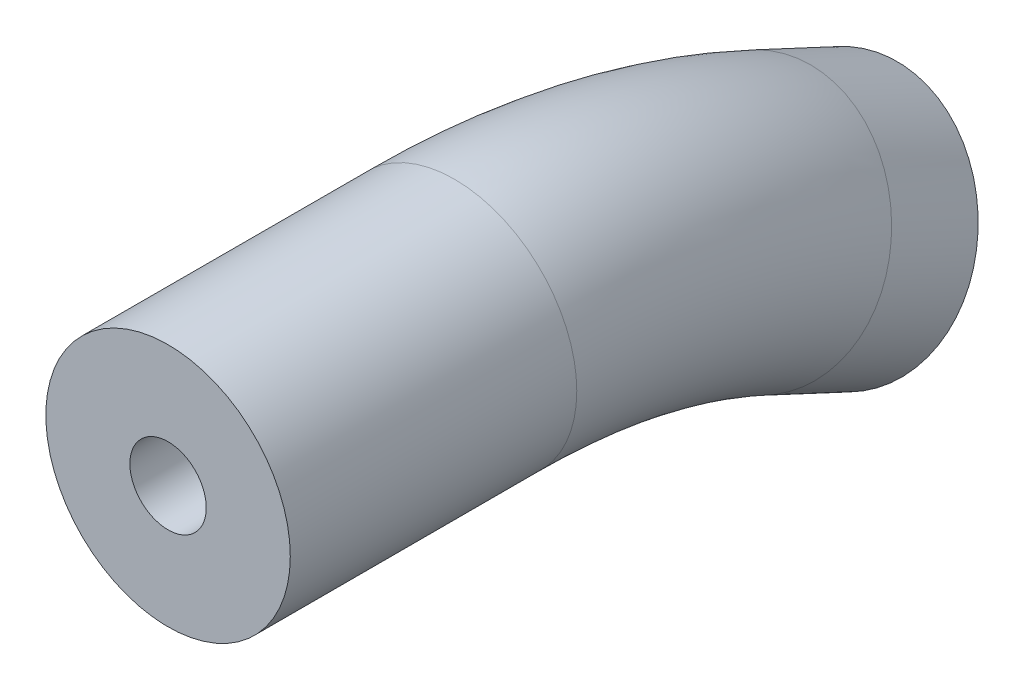
ISO-10303-21;
HEADER;
FILE_DESCRIPTION(('STEP AP214'),'2;1');
FILE_NAME('part.step','',(''),(''),'','','');
FILE_SCHEMA(('AUTOMOTIVE_DESIGN { 1 0 10303 214 1 1 1 1 }'));
ENDSEC;
DATA;
#1=APPLICATION_CONTEXT('core data for automotive mechanical design processes');
#2=APPLICATION_PROTOCOL_DEFINITION('international standard','automotive_design',2000,#1);
#3=PRODUCT_CONTEXT('',#1,'mechanical');
#4=PRODUCT('Part','Part','',(#3));
#5=PRODUCT_RELATED_PRODUCT_CATEGORY('part','',(#4));
#6=PRODUCT_DEFINITION_FORMATION('','',#4);
#7=PRODUCT_DEFINITION_CONTEXT('part definition',#1,'design');
#8=PRODUCT_DEFINITION('design','',#6,#7);
#9=PRODUCT_DEFINITION_SHAPE('','',#8);
#10=(LENGTH_UNIT() NAMED_UNIT(*) SI_UNIT(.MILLI.,.METRE.));
#11=(NAMED_UNIT(*) PLANE_ANGLE_UNIT() SI_UNIT($,.RADIAN.));
#12=(NAMED_UNIT(*) SI_UNIT($,.STERADIAN.) SOLID_ANGLE_UNIT());
#13=UNCERTAINTY_MEASURE_WITH_UNIT(LENGTH_MEASURE(1.E-05),#10,'distance_accuracy_value','');
#14=(GEOMETRIC_REPRESENTATION_CONTEXT(3) GLOBAL_UNCERTAINTY_ASSIGNED_CONTEXT((#13)) GLOBAL_UNIT_ASSIGNED_CONTEXT((#10,
#11,#12)) REPRESENTATION_CONTEXT('',''));
#15=CARTESIAN_POINT('',(0.,0.,0.));
#16=DIRECTION('',(0.,0.,1.));
#17=DIRECTION('',(1.,0.,0.));
#18=AXIS2_PLACEMENT_3D('',#15,#16,#17);
#19=CARTESIAN_POINT('',(10.125,-4.2,-8.02));
#20=DIRECTION('',(0.,0.,-1.));
#21=DIRECTION('',(-1.,0.,0.));
#22=AXIS2_PLACEMENT_3D('',#19,#20,#21);
#23=CYLINDRICAL_SURFACE('',#22,0.2);
#24=CARTESIAN_POINT('',(10.125,-4.2,-9.52));
#25=DIRECTION('',(0.,0.,1.));
#26=DIRECTION('',(1.,0.,0.));
#27=AXIS2_PLACEMENT_3D('',#24,#25,#26);
#28=CIRCLE('',#27,0.199999999999999);
#29=CARTESIAN_POINT('',(10.325,-4.2,-9.52));
#30=VERTEX_POINT('',#29);
#31=EDGE_CURVE('E62',#30,#30,#28,.T.);
#32=ORIENTED_EDGE('',*,*,#31,.F.);
#33=EDGE_LOOP('',(#32));
#34=FACE_BOUND('',#33,.T.);
#35=CARTESIAN_POINT('',(10.125,-4.2,-8.02));
#36=DIRECTION('',(0.,0.,-1.));
#37=DIRECTION('',(-1.,0.,0.));
#38=AXIS2_PLACEMENT_3D('',#35,#36,#37);
#39=CIRCLE('',#38,0.2);
#40=CARTESIAN_POINT('',(9.925,-4.2,-8.02));
#41=VERTEX_POINT('',#40);
#42=EDGE_CURVE('E56',#41,#41,#39,.T.);
#43=ORIENTED_EDGE('',*,*,#42,.F.);
#44=EDGE_LOOP('',(#43));
#45=FACE_BOUND('',#44,.T.);
#46=ADVANCED_FACE('F17',(#34,#45),#23,.F.);
#47=CARTESIAN_POINT('',(10.125,-7.97099703639013,-9.52));
#48=DIRECTION('',(1.,0.,0.));
#49=DIRECTION('',(0.,0.,-1.));
#50=AXIS2_PLACEMENT_3D('',#47,#48,#49);
#51=TOROIDAL_SURFACE('',#50,3.77099703639014,0.200000000000003);
#52=ORIENTED_EDGE('',*,*,#31,.T.);
#53=EDGE_LOOP('',(#52));
#54=FACE_BOUND('',#53,.T.);
#55=CARTESIAN_POINT('',(10.125,-4.5533130573974,-11.1136922125105));
#56=DIRECTION('',(0.,0.422618261740958,0.906307787036529));
#57=DIRECTION('',(0.,-0.906307787036529,0.422618261740958));
#58=AXIS2_PLACEMENT_3D('',#55,#56,#57);
#59=CIRCLE('',#58,0.200000000000007);
#60=CARTESIAN_POINT('',(10.125,-4.73457461480471,-11.0291685601623));
#61=VERTEX_POINT('',#60);
#62=EDGE_CURVE('E53',#61,#61,#59,.T.);
#63=ORIENTED_EDGE('',*,*,#62,.F.);
#64=EDGE_LOOP('',(#63));
#65=FACE_BOUND('',#64,.T.);
#66=ADVANCED_FACE('F66',(#54,#65),#51,.F.);
#67=CARTESIAN_POINT('',(10.766,-3.559,-8.02));
#68=DIRECTION('',(0.,0.,1.));
#69=DIRECTION('',(-1.,0.,0.));
#70=AXIS2_PLACEMENT_3D('',#67,#68,#69);
#71=PLANE('',#70);
#72=ORIENTED_EDGE('',*,*,#42,.T.);
#73=EDGE_LOOP('',(#72));
#74=FACE_BOUND('',#73,.T.);
#75=CARTESIAN_POINT('',(10.125,-4.2,-8.02));
#76=DIRECTION('',(0.,0.,1.));
#77=DIRECTION('',(1.,0.,0.));
#78=AXIS2_PLACEMENT_3D('',#75,#76,#77);
#79=CIRCLE('',#78,0.639999999999999);
#80=CARTESIAN_POINT('',(10.765,-4.2,-8.02));
#81=VERTEX_POINT('',#80);
#82=EDGE_CURVE('E48',#81,#81,#79,.F.);
#83=ORIENTED_EDGE('',*,*,#82,.F.);
#84=EDGE_LOOP('',(#83));
#85=FACE_BOUND('',#84,.T.);
#86=ADVANCED_FACE('F74',(#74,#85),#71,.T.);
#87=CARTESIAN_POINT('',(10.125,-4.5533130573974,-11.1136922125105));
#88=DIRECTION('',(0.,-0.422618261740958,-0.906307787036529));
#89=DIRECTION('',(0.,0.906307787036529,-0.422618261740958));
#90=AXIS2_PLACEMENT_3D('',#87,#88,#89);
#91=CYLINDRICAL_SURFACE('',#90,0.200000000000007);
#92=CARTESIAN_POINT('',(10.125,-4.7646221884788,-11.5668461064811));
#93=DIRECTION('',(0.,-0.422618261740958,-0.906307787036529));
#94=DIRECTION('',(0.,0.906307787036529,-0.422618261740958));
#95=AXIS2_PLACEMENT_3D('',#92,#93,#94);
#96=CIRCLE('',#95,0.200000000000007);
#97=CARTESIAN_POINT('',(10.125,-4.58336063107149,-11.6513697588293));
#98=VERTEX_POINT('',#97);
#99=EDGE_CURVE('E45',#98,#98,#96,.F.);
#100=ORIENTED_EDGE('',*,*,#99,.F.);
#101=EDGE_LOOP('',(#100));
#102=FACE_BOUND('',#101,.T.);
#103=ORIENTED_EDGE('',*,*,#62,.T.);
#104=EDGE_LOOP('',(#103));
#105=FACE_BOUND('',#104,.T.);
#106=ADVANCED_FACE('F77',(#102,#105),#91,.F.);
#107=CARTESIAN_POINT('',(10.125,-4.2,-9.52));
#108=DIRECTION('',(0.,0.,1.));
#109=DIRECTION('',(1.,0.,0.));
#110=AXIS2_PLACEMENT_3D('',#107,#108,#109);
#111=CYLINDRICAL_SURFACE('',#110,0.639999999999999);
#112=ORIENTED_EDGE('',*,*,#82,.T.);
#113=EDGE_LOOP('',(#112));
#114=FACE_BOUND('',#113,.T.);
#115=CARTESIAN_POINT('',(10.125,-4.2,-9.52));
#116=DIRECTION('',(0.,0.,-1.));
#117=DIRECTION('',(-1.,0.,0.));
#118=AXIS2_PLACEMENT_3D('',#115,#116,#117);
#119=CIRCLE('',#118,0.639999999999999);
#120=CARTESIAN_POINT('',(9.485,-4.2,-9.52));
#121=VERTEX_POINT('',#120);
#122=EDGE_CURVE('E36',#121,#121,#119,.T.);
#123=ORIENTED_EDGE('',*,*,#122,.F.);
#124=EDGE_LOOP('',(#123));
#125=FACE_BOUND('',#124,.T.);
#126=ADVANCED_FACE('F81',(#114,#125),#111,.T.);
#127=CARTESIAN_POINT('',(9.484,-4.18367889700396,-11.8377444122497));
#128=DIRECTION('',(0.,-0.422618261740863,-0.906307787036574));
#129=DIRECTION('',(1.,0.,0.));
#130=AXIS2_PLACEMENT_3D('',#127,#128,#129);
#131=PLANE('',#130);
#132=ORIENTED_EDGE('',*,*,#99,.T.);
#133=EDGE_LOOP('',(#132));
#134=FACE_BOUND('',#133,.T.);
#135=CARTESIAN_POINT('',(10.125,-4.76462218847872,-11.5668461064811));
#136=DIRECTION('',(0.,0.422618261740778,0.906307787036613));
#137=DIRECTION('',(0.,-0.906307787036613,0.422618261740778));
#138=AXIS2_PLACEMENT_3D('',#135,#136,#137);
#139=CIRCLE('',#138,0.640000000000002);
#140=CARTESIAN_POINT('',(10.125,-5.34465917218216,-11.296370418967));
#141=VERTEX_POINT('',#140);
#142=EDGE_CURVE('E26',#141,#141,#139,.T.);
#143=ORIENTED_EDGE('',*,*,#142,.F.);
#144=EDGE_LOOP('',(#143));
#145=FACE_BOUND('',#144,.T.);
#146=ADVANCED_FACE('F41',(#134,#145),#131,.T.);
#147=CARTESIAN_POINT('',(10.125,-7.97099703645936,-9.51999999998462));
#148=DIRECTION('',(1.,0.,0.));
#149=DIRECTION('',(0.,1.,0.));
#150=AXIS2_PLACEMENT_3D('',#147,#148,#149);
#151=TOROIDAL_SURFACE('',#150,3.77099703645937,0.64);
#152=CARTESIAN_POINT('',(10.125,-4.55331305739947,-11.1136922125096));
#153=DIRECTION('',(0.,0.422618261730355,0.906307787041474));
#154=DIRECTION('',(0.,-0.906307787041474,0.422618261730355));
#155=AXIS2_PLACEMENT_3D('',#152,#153,#154);
#156=CIRCLE('',#155,0.639999999999996);
#157=CARTESIAN_POINT('',(9.485,-4.55331305740871,-11.1136922125052));
#158=VERTEX_POINT('',#157);
#159=CARTESIAN_POINT('',(10.125,-5.13335004111153,-10.8432165250153));
#160=VERTEX_POINT('',#159);
#161=EDGE_CURVE('E33',#158,#160,#156,.T.);
#162=ORIENTED_EDGE('',*,*,#161,.T.);
#163=CARTESIAN_POINT('',(10.125,-4.5533130573974,-11.1136922125105));
#164=DIRECTION('',(0.,-0.422618261740916,-0.906307787036549));
#165=DIRECTION('',(0.,0.906307787036549,-0.422618261740916));
#166=AXIS2_PLACEMENT_3D('',#163,#164,#165);
#167=CIRCLE('',#166,0.640000000000015);
#168=EDGE_CURVE('E11',#158,#160,#167,.T.);
#169=ORIENTED_EDGE('',*,*,#168,.F.);
#170=EDGE_LOOP('',(#162,#169));
#171=FACE_BOUND('',#170,.T.);
#172=ORIENTED_EDGE('',*,*,#122,.T.);
#173=EDGE_LOOP('',(#172));
#174=FACE_BOUND('',#173,.T.);
#175=ADVANCED_FACE('F38',(#171,#174),#151,.T.);
#176=CARTESIAN_POINT('',(10.125,-4.7646221884443,-11.5668461064073));
#177=DIRECTION('',(0.,0.422618261740778,0.906307787036613));
#178=DIRECTION('',(0.,-0.906307787036613,0.422618261740778));
#179=AXIS2_PLACEMENT_3D('',#176,#177,#178);
#180=CYLINDRICAL_SURFACE('',#179,0.640000000000002);
#181=ORIENTED_EDGE('',*,*,#161,.F.);
#182=ORIENTED_EDGE('',*,*,#168,.T.);
#183=EDGE_LOOP('',(#181,#182));
#184=FACE_BOUND('',#183,.T.);
#185=ORIENTED_EDGE('',*,*,#142,.T.);
#186=EDGE_LOOP('',(#185));
#187=FACE_BOUND('',#186,.T.);
#188=ADVANCED_FACE('F19',(#184,#187),#180,.T.);
#189=CLOSED_SHELL('',(#46,#66,#86,#106,#126,#146,#175,#188));
#190=MANIFOLD_SOLID_BREP('B1',#189);
#191=ADVANCED_BREP_SHAPE_REPRESENTATION('',(#18,#190),#14);
#192=SHAPE_DEFINITION_REPRESENTATION(#9,#191);
ENDSEC;
END-ISO-10303-21;
